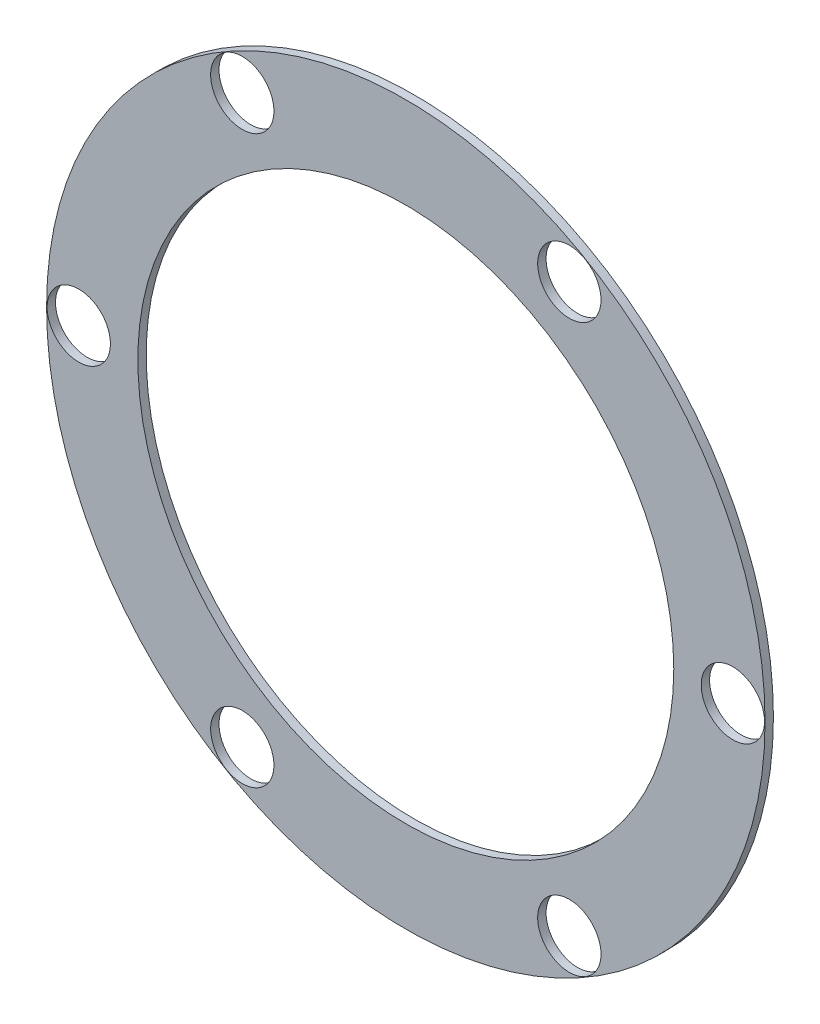
ISO-10303-21;
HEADER;
FILE_DESCRIPTION(('STEP AP214'),'2;1');
FILE_NAME('part.step','',(''),(''),'','','');
FILE_SCHEMA(('AUTOMOTIVE_DESIGN { 1 0 10303 214 1 1 1 1 }'));
ENDSEC;
DATA;
#1=APPLICATION_CONTEXT('core data for automotive mechanical design processes');
#2=APPLICATION_PROTOCOL_DEFINITION('international standard','automotive_design',2000,#1);
#3=PRODUCT_CONTEXT('',#1,'mechanical');
#4=PRODUCT('Part','Part','',(#3));
#5=PRODUCT_RELATED_PRODUCT_CATEGORY('part','',(#4));
#6=PRODUCT_DEFINITION_FORMATION('','',#4);
#7=PRODUCT_DEFINITION_CONTEXT('part definition',#1,'design');
#8=PRODUCT_DEFINITION('design','',#6,#7);
#9=PRODUCT_DEFINITION_SHAPE('','',#8);
#10=(LENGTH_UNIT() NAMED_UNIT(*) SI_UNIT(.MILLI.,.METRE.));
#11=(NAMED_UNIT(*) PLANE_ANGLE_UNIT() SI_UNIT($,.RADIAN.));
#12=(NAMED_UNIT(*) SI_UNIT($,.STERADIAN.) SOLID_ANGLE_UNIT());
#13=UNCERTAINTY_MEASURE_WITH_UNIT(LENGTH_MEASURE(1.E-05),#10,'distance_accuracy_value','');
#14=(GEOMETRIC_REPRESENTATION_CONTEXT(3) GLOBAL_UNCERTAINTY_ASSIGNED_CONTEXT((#13)) GLOBAL_UNIT_ASSIGNED_CONTEXT((#10,
#11,#12)) REPRESENTATION_CONTEXT('',''));
#15=CARTESIAN_POINT('',(0.,0.,0.));
#16=DIRECTION('',(0.,0.,1.));
#17=DIRECTION('',(1.,0.,0.));
#18=AXIS2_PLACEMENT_3D('',#15,#16,#17);
#19=CARTESIAN_POINT('',(7.74999999999988,-13.4233937586589,0.396875));
#20=DIRECTION('',(0.,0.,-1.));
#21=DIRECTION('',(-1.,0.,0.));
#22=AXIS2_PLACEMENT_3D('',#19,#20,#21);
#23=CYLINDRICAL_SURFACE('',#22,1.5);
#24=CARTESIAN_POINT('',(7.74999999999988,-13.4233937586589,0.396875));
#25=DIRECTION('',(0.,0.,1.));
#26=DIRECTION('',(1.,0.,0.));
#27=AXIS2_PLACEMENT_3D('',#24,#25,#26);
#28=CIRCLE('',#27,1.5);
#29=CARTESIAN_POINT('',(9.24999999999988,-13.4233937586589,0.396875));
#30=VERTEX_POINT('',#29);
#31=EDGE_CURVE('E48',#30,#30,#28,.T.);
#32=ORIENTED_EDGE('',*,*,#31,.T.);
#33=EDGE_LOOP('',(#32));
#34=FACE_BOUND('',#33,.T.);
#35=CARTESIAN_POINT('',(7.74999999999988,-13.4233937586589,0.));
#36=DIRECTION('',(0.,0.,1.));
#37=DIRECTION('',(1.,0.,0.));
#38=AXIS2_PLACEMENT_3D('',#35,#36,#37);
#39=CIRCLE('',#38,1.5);
#40=CARTESIAN_POINT('',(9.24999999999988,-13.4233937586589,0.));
#41=VERTEX_POINT('',#40);
#42=EDGE_CURVE('E81',#41,#41,#39,.T.);
#43=ORIENTED_EDGE('',*,*,#42,.F.);
#44=EDGE_LOOP('',(#43));
#45=FACE_BOUND('',#44,.T.);
#46=ADVANCED_FACE('F39',(#34,#45),#23,.F.);
#47=CARTESIAN_POINT('',(15.5,-1.08235921504137E-13,0.396875));
#48=DIRECTION('',(0.,0.,-1.));
#49=DIRECTION('',(-1.,0.,0.));
#50=AXIS2_PLACEMENT_3D('',#47,#48,#49);
#51=CYLINDRICAL_SURFACE('',#50,1.5);
#52=CARTESIAN_POINT('',(15.5,-1.08235921504137E-13,0.396875));
#53=DIRECTION('',(0.,0.,1.));
#54=DIRECTION('',(1.,0.,0.));
#55=AXIS2_PLACEMENT_3D('',#52,#53,#54);
#56=CIRCLE('',#55,1.5);
#57=CARTESIAN_POINT('',(17.,-1.08235921504137E-13,0.396875));
#58=VERTEX_POINT('',#57);
#59=EDGE_CURVE('E54',#58,#58,#56,.T.);
#60=ORIENTED_EDGE('',*,*,#59,.T.);
#61=EDGE_LOOP('',(#60));
#62=FACE_BOUND('',#61,.T.);
#63=CARTESIAN_POINT('',(15.5,-1.08235921504137E-13,0.));
#64=DIRECTION('',(0.,0.,1.));
#65=DIRECTION('',(1.,0.,0.));
#66=AXIS2_PLACEMENT_3D('',#63,#64,#65);
#67=CIRCLE('',#66,1.5);
#68=CARTESIAN_POINT('',(17.,-1.08235921504137E-13,0.));
#69=VERTEX_POINT('',#68);
#70=EDGE_CURVE('E78',#69,#69,#67,.T.);
#71=ORIENTED_EDGE('',*,*,#70,.F.);
#72=EDGE_LOOP('',(#71));
#73=FACE_BOUND('',#72,.T.);
#74=ADVANCED_FACE('F116',(#62,#73),#51,.F.);
#75=CARTESIAN_POINT('',(7.75000000000006,13.4233937586588,0.396875));
#76=DIRECTION('',(0.,0.,-1.));
#77=DIRECTION('',(-1.,0.,0.));
#78=AXIS2_PLACEMENT_3D('',#75,#76,#77);
#79=CYLINDRICAL_SURFACE('',#78,1.5);
#80=CARTESIAN_POINT('',(7.75000000000006,13.4233937586588,0.396875));
#81=DIRECTION('',(0.,0.,1.));
#82=DIRECTION('',(1.,0.,0.));
#83=AXIS2_PLACEMENT_3D('',#80,#81,#82);
#84=CIRCLE('',#83,1.5);
#85=CARTESIAN_POINT('',(9.25000000000007,13.4233937586588,0.396875));
#86=VERTEX_POINT('',#85);
#87=EDGE_CURVE('E109',#86,#86,#84,.T.);
#88=ORIENTED_EDGE('',*,*,#87,.T.);
#89=EDGE_LOOP('',(#88));
#90=FACE_BOUND('',#89,.T.);
#91=CARTESIAN_POINT('',(7.75000000000006,13.4233937586588,0.));
#92=DIRECTION('',(0.,0.,1.));
#93=DIRECTION('',(1.,0.,0.));
#94=AXIS2_PLACEMENT_3D('',#91,#92,#93);
#95=CIRCLE('',#94,1.5);
#96=CARTESIAN_POINT('',(9.25000000000007,13.4233937586588,0.));
#97=VERTEX_POINT('',#96);
#98=EDGE_CURVE('E74',#97,#97,#95,.T.);
#99=ORIENTED_EDGE('',*,*,#98,.F.);
#100=EDGE_LOOP('',(#99));
#101=FACE_BOUND('',#100,.T.);
#102=ADVANCED_FACE('F134',(#90,#101),#79,.F.);
#103=CARTESIAN_POINT('',(-7.74999999999997,13.4233937586588,0.396875));
#104=DIRECTION('',(0.,0.,-1.));
#105=DIRECTION('',(-1.,0.,0.));
#106=AXIS2_PLACEMENT_3D('',#103,#104,#105);
#107=CYLINDRICAL_SURFACE('',#106,1.5);
#108=CARTESIAN_POINT('',(-7.74999999999997,13.4233937586588,0.396875));
#109=DIRECTION('',(0.,0.,1.));
#110=DIRECTION('',(1.,0.,0.));
#111=AXIS2_PLACEMENT_3D('',#108,#109,#110);
#112=CIRCLE('',#111,1.5);
#113=CARTESIAN_POINT('',(-6.24999999999997,13.4233937586588,0.396875));
#114=VERTEX_POINT('',#113);
#115=EDGE_CURVE('E105',#114,#114,#112,.T.);
#116=ORIENTED_EDGE('',*,*,#115,.T.);
#117=EDGE_LOOP('',(#116));
#118=FACE_BOUND('',#117,.T.);
#119=CARTESIAN_POINT('',(-7.74999999999997,13.4233937586588,0.));
#120=DIRECTION('',(0.,0.,1.));
#121=DIRECTION('',(1.,0.,0.));
#122=AXIS2_PLACEMENT_3D('',#119,#120,#121);
#123=CIRCLE('',#122,1.5);
#124=CARTESIAN_POINT('',(-6.24999999999997,13.4233937586588,0.));
#125=VERTEX_POINT('',#124);
#126=EDGE_CURVE('E70',#125,#125,#123,.T.);
#127=ORIENTED_EDGE('',*,*,#126,.F.);
#128=EDGE_LOOP('',(#127));
#129=FACE_BOUND('',#128,.T.);
#130=ADVANCED_FACE('F141',(#118,#129),#107,.F.);
#131=CARTESIAN_POINT('',(-15.5,0.,0.396875));
#132=DIRECTION('',(0.,0.,-1.));
#133=DIRECTION('',(-1.,0.,0.));
#134=AXIS2_PLACEMENT_3D('',#131,#132,#133);
#135=CYLINDRICAL_SURFACE('',#134,1.5);
#136=CARTESIAN_POINT('',(-15.5,0.,0.396875));
#137=DIRECTION('',(0.,0.,1.));
#138=DIRECTION('',(1.,0.,0.));
#139=AXIS2_PLACEMENT_3D('',#136,#137,#138);
#140=CIRCLE('',#139,1.5);
#141=CARTESIAN_POINT('',(-14.,0.,0.396875));
#142=VERTEX_POINT('',#141);
#143=EDGE_CURVE('E99',#142,#142,#140,.T.);
#144=ORIENTED_EDGE('',*,*,#143,.T.);
#145=EDGE_LOOP('',(#144));
#146=FACE_BOUND('',#145,.T.);
#147=CARTESIAN_POINT('',(-15.5,0.,0.));
#148=DIRECTION('',(0.,0.,1.));
#149=DIRECTION('',(1.,0.,0.));
#150=AXIS2_PLACEMENT_3D('',#147,#148,#149);
#151=CIRCLE('',#150,1.5);
#152=CARTESIAN_POINT('',(-14.,0.,0.));
#153=VERTEX_POINT('',#152);
#154=EDGE_CURVE('E66',#153,#153,#151,.T.);
#155=ORIENTED_EDGE('',*,*,#154,.F.);
#156=EDGE_LOOP('',(#155));
#157=FACE_BOUND('',#156,.T.);
#158=ADVANCED_FACE('F145',(#146,#157),#135,.F.);
#159=CARTESIAN_POINT('',(0.,0.,0.396875));
#160=DIRECTION('',(0.,0.,-1.));
#161=DIRECTION('',(-1.,0.,0.));
#162=AXIS2_PLACEMENT_3D('',#159,#160,#161);
#163=CYLINDRICAL_SURFACE('',#162,12.7);
#164=CARTESIAN_POINT('',(0.,0.,0.396875));
#165=DIRECTION('',(0.,0.,1.));
#166=DIRECTION('',(1.,0.,0.));
#167=AXIS2_PLACEMENT_3D('',#164,#165,#166);
#168=CIRCLE('',#167,12.7);
#169=CARTESIAN_POINT('',(12.7,0.,0.396875));
#170=VERTEX_POINT('',#169);
#171=EDGE_CURVE('E93',#170,#170,#168,.T.);
#172=ORIENTED_EDGE('',*,*,#171,.T.);
#173=EDGE_LOOP('',(#172));
#174=FACE_BOUND('',#173,.T.);
#175=CARTESIAN_POINT('',(0.,0.,0.));
#176=DIRECTION('',(0.,0.,1.));
#177=DIRECTION('',(1.,0.,0.));
#178=AXIS2_PLACEMENT_3D('',#175,#176,#177);
#179=CIRCLE('',#178,12.7);
#180=CARTESIAN_POINT('',(12.7,0.,0.));
#181=VERTEX_POINT('',#180);
#182=EDGE_CURVE('E62',#181,#181,#179,.T.);
#183=ORIENTED_EDGE('',*,*,#182,.F.);
#184=EDGE_LOOP('',(#183));
#185=FACE_BOUND('',#184,.T.);
#186=ADVANCED_FACE('F148',(#174,#185),#163,.F.);
#187=CARTESIAN_POINT('',(0.,0.,0.396875));
#188=DIRECTION('',(0.,0.,-1.));
#189=DIRECTION('',(-1.,0.,0.));
#190=AXIS2_PLACEMENT_3D('',#187,#188,#189);
#191=CYLINDRICAL_SURFACE('',#190,17.0256792441741);
#192=CARTESIAN_POINT('',(0.,0.,0.396875));
#193=DIRECTION('',(0.,0.,1.));
#194=DIRECTION('',(1.,0.,0.));
#195=AXIS2_PLACEMENT_3D('',#192,#193,#194);
#196=CIRCLE('',#195,17.0256792441741);
#197=CARTESIAN_POINT('',(17.0256792441741,0.,0.396875));
#198=VERTEX_POINT('',#197);
#199=EDGE_CURVE('E88',#198,#198,#196,.T.);
#200=ORIENTED_EDGE('',*,*,#199,.F.);
#201=EDGE_LOOP('',(#200));
#202=FACE_BOUND('',#201,.T.);
#203=CARTESIAN_POINT('',(0.,0.,0.));
#204=DIRECTION('',(0.,0.,1.));
#205=DIRECTION('',(1.,0.,0.));
#206=AXIS2_PLACEMENT_3D('',#203,#204,#205);
#207=CIRCLE('',#206,17.0256792441741);
#208=CARTESIAN_POINT('',(17.0256792441741,0.,0.));
#209=VERTEX_POINT('',#208);
#210=EDGE_CURVE('E58',#209,#209,#207,.T.);
#211=ORIENTED_EDGE('',*,*,#210,.T.);
#212=EDGE_LOOP('',(#211));
#213=FACE_BOUND('',#212,.T.);
#214=ADVANCED_FACE('F41',(#202,#213),#191,.T.);
#215=CARTESIAN_POINT('',(-7.75000000000016,-13.4233937586587,0.396875));
#216=DIRECTION('',(0.,0.,-1.));
#217=DIRECTION('',(-1.,0.,0.));
#218=AXIS2_PLACEMENT_3D('',#215,#216,#217);
#219=CYLINDRICAL_SURFACE('',#218,1.5);
#220=CARTESIAN_POINT('',(-7.75000000000016,-13.4233937586587,0.396875));
#221=DIRECTION('',(0.,0.,1.));
#222=DIRECTION('',(1.,0.,0.));
#223=AXIS2_PLACEMENT_3D('',#220,#221,#222);
#224=CIRCLE('',#223,1.5);
#225=CARTESIAN_POINT('',(-6.25000000000016,-13.4233937586587,0.396875));
#226=VERTEX_POINT('',#225);
#227=EDGE_CURVE('E10',#226,#226,#224,.T.);
#228=ORIENTED_EDGE('',*,*,#227,.T.);
#229=EDGE_LOOP('',(#228));
#230=FACE_BOUND('',#229,.T.);
#231=CARTESIAN_POINT('',(-7.75000000000016,-13.4233937586587,0.));
#232=DIRECTION('',(0.,0.,1.));
#233=DIRECTION('',(1.,0.,0.));
#234=AXIS2_PLACEMENT_3D('',#231,#232,#233);
#235=CIRCLE('',#234,1.5);
#236=CARTESIAN_POINT('',(-6.25000000000016,-13.4233937586587,0.));
#237=VERTEX_POINT('',#236);
#238=EDGE_CURVE('E43',#237,#237,#235,.T.);
#239=ORIENTED_EDGE('',*,*,#238,.F.);
#240=EDGE_LOOP('',(#239));
#241=FACE_BOUND('',#240,.T.);
#242=ADVANCED_FACE('F123',(#230,#241),#219,.F.);
#243=CARTESIAN_POINT('',(0.,0.,0.396875));
#244=DIRECTION('',(0.,0.,1.));
#245=DIRECTION('',(1.,0.,0.));
#246=AXIS2_PLACEMENT_3D('',#243,#244,#245);
#247=PLANE('',#246);
#248=ORIENTED_EDGE('',*,*,#199,.T.);
#249=EDGE_LOOP('',(#248));
#250=FACE_BOUND('',#249,.T.);
#251=ORIENTED_EDGE('',*,*,#171,.F.);
#252=EDGE_LOOP('',(#251));
#253=FACE_BOUND('',#252,.T.);
#254=ORIENTED_EDGE('',*,*,#143,.F.);
#255=EDGE_LOOP('',(#254));
#256=FACE_BOUND('',#255,.T.);
#257=ORIENTED_EDGE('',*,*,#115,.F.);
#258=EDGE_LOOP('',(#257));
#259=FACE_BOUND('',#258,.T.);
#260=ORIENTED_EDGE('',*,*,#87,.F.);
#261=EDGE_LOOP('',(#260));
#262=FACE_BOUND('',#261,.T.);
#263=ORIENTED_EDGE('',*,*,#59,.F.);
#264=EDGE_LOOP('',(#263));
#265=FACE_BOUND('',#264,.T.);
#266=ORIENTED_EDGE('',*,*,#31,.F.);
#267=EDGE_LOOP('',(#266));
#268=FACE_BOUND('',#267,.T.);
#269=ORIENTED_EDGE('',*,*,#227,.F.);
#270=EDGE_LOOP('',(#269));
#271=FACE_BOUND('',#270,.T.);
#272=ADVANCED_FACE('F119',(#250,#253,#256,#259,#262,#265,#268,#271),#247,.T.);
#273=CARTESIAN_POINT('',(0.,0.,0.));
#274=DIRECTION('',(0.,0.,1.));
#275=DIRECTION('',(1.,0.,0.));
#276=AXIS2_PLACEMENT_3D('',#273,#274,#275);
#277=PLANE('',#276);
#278=ORIENTED_EDGE('',*,*,#210,.F.);
#279=EDGE_LOOP('',(#278));
#280=FACE_BOUND('',#279,.T.);
#281=ORIENTED_EDGE('',*,*,#182,.T.);
#282=EDGE_LOOP('',(#281));
#283=FACE_BOUND('',#282,.T.);
#284=ORIENTED_EDGE('',*,*,#154,.T.);
#285=EDGE_LOOP('',(#284));
#286=FACE_BOUND('',#285,.T.);
#287=ORIENTED_EDGE('',*,*,#126,.T.);
#288=EDGE_LOOP('',(#287));
#289=FACE_BOUND('',#288,.T.);
#290=ORIENTED_EDGE('',*,*,#98,.T.);
#291=EDGE_LOOP('',(#290));
#292=FACE_BOUND('',#291,.T.);
#293=ORIENTED_EDGE('',*,*,#70,.T.);
#294=EDGE_LOOP('',(#293));
#295=FACE_BOUND('',#294,.T.);
#296=ORIENTED_EDGE('',*,*,#42,.T.);
#297=EDGE_LOOP('',(#296));
#298=FACE_BOUND('',#297,.T.);
#299=ORIENTED_EDGE('',*,*,#238,.T.);
#300=EDGE_LOOP('',(#299));
#301=FACE_BOUND('',#300,.T.);
#302=ADVANCED_FACE('F122',(#280,#283,#286,#289,#292,#295,#298,#301),#277,.F.);
#303=CLOSED_SHELL('',(#46,#74,#102,#130,#158,#186,#214,#242,#272,#302));
#304=MANIFOLD_SOLID_BREP('B2',#303);
#305=ADVANCED_BREP_SHAPE_REPRESENTATION('',(#18,#304),#14);
#306=SHAPE_DEFINITION_REPRESENTATION(#9,#305);
ENDSEC;
END-ISO-10303-21;
